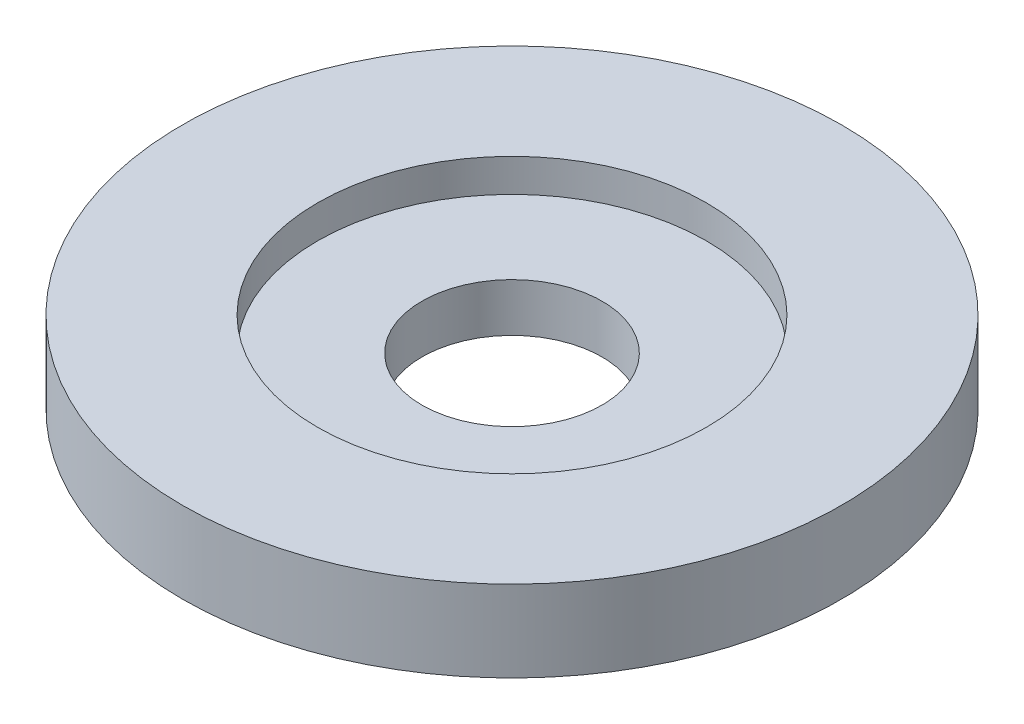
ISO-10303-21;
HEADER;
FILE_DESCRIPTION(('STEP AP214'),'2;1');
FILE_NAME('part.step','',(''),(''),'','','');
FILE_SCHEMA(('AUTOMOTIVE_DESIGN { 1 0 10303 214 1 1 1 1 }'));
ENDSEC;
DATA;
#1=APPLICATION_CONTEXT('core data for automotive mechanical design processes');
#2=APPLICATION_PROTOCOL_DEFINITION('international standard','automotive_design',2000,#1);
#3=PRODUCT_CONTEXT('',#1,'mechanical');
#4=PRODUCT('Part','Part','',(#3));
#5=PRODUCT_RELATED_PRODUCT_CATEGORY('part','',(#4));
#6=PRODUCT_DEFINITION_FORMATION('','',#4);
#7=PRODUCT_DEFINITION_CONTEXT('part definition',#1,'design');
#8=PRODUCT_DEFINITION('design','',#6,#7);
#9=PRODUCT_DEFINITION_SHAPE('','',#8);
#10=(LENGTH_UNIT() NAMED_UNIT(*) SI_UNIT(.MILLI.,.METRE.));
#11=(NAMED_UNIT(*) PLANE_ANGLE_UNIT() SI_UNIT($,.RADIAN.));
#12=(NAMED_UNIT(*) SI_UNIT($,.STERADIAN.) SOLID_ANGLE_UNIT());
#13=UNCERTAINTY_MEASURE_WITH_UNIT(LENGTH_MEASURE(1.E-05),#10,'distance_accuracy_value','');
#14=(GEOMETRIC_REPRESENTATION_CONTEXT(3) GLOBAL_UNCERTAINTY_ASSIGNED_CONTEXT((#13)) GLOBAL_UNIT_ASSIGNED_CONTEXT((#10,
#11,#12)) REPRESENTATION_CONTEXT('',''));
#15=CARTESIAN_POINT('',(0.,0.,0.));
#16=DIRECTION('',(0.,0.,1.));
#17=DIRECTION('',(1.,0.,0.));
#18=AXIS2_PLACEMENT_3D('',#15,#16,#17);
#19=CARTESIAN_POINT('',(0.,-4.699,0.));
#20=DIRECTION('',(0.,1.,0.));
#21=DIRECTION('',(0.,0.,1.));
#22=AXIS2_PLACEMENT_3D('',#19,#20,#21);
#23=CYLINDRICAL_SURFACE('',#22,19.05);
#24=CARTESIAN_POINT('',(0.,-4.699,0.));
#25=DIRECTION('',(0.,1.,0.));
#26=DIRECTION('',(0.,0.,1.));
#27=AXIS2_PLACEMENT_3D('',#24,#25,#26);
#28=CIRCLE('',#27,19.05);
#29=CARTESIAN_POINT('',(0.,-4.699,19.05));
#30=VERTEX_POINT('',#29);
#31=EDGE_CURVE('E10',#30,#30,#28,.T.);
#32=ORIENTED_EDGE('',*,*,#31,.T.);
#33=EDGE_LOOP('',(#32));
#34=FACE_BOUND('',#33,.T.);
#35=CARTESIAN_POINT('',(0.,0.,0.));
#36=DIRECTION('',(0.,1.,0.));
#37=DIRECTION('',(0.,0.,1.));
#38=AXIS2_PLACEMENT_3D('',#35,#36,#37);
#39=CIRCLE('',#38,19.05);
#40=CARTESIAN_POINT('',(0.,0.,19.05));
#41=VERTEX_POINT('',#40);
#42=EDGE_CURVE('E50',#41,#41,#39,.T.);
#43=ORIENTED_EDGE('',*,*,#42,.F.);
#44=EDGE_LOOP('',(#43));
#45=FACE_BOUND('',#44,.T.);
#46=ADVANCED_FACE('F43',(#34,#45),#23,.T.);
#47=CARTESIAN_POINT('',(0.,-4.699,0.));
#48=DIRECTION('',(0.,1.,0.));
#49=DIRECTION('',(0.,0.,1.));
#50=AXIS2_PLACEMENT_3D('',#47,#48,#49);
#51=PLANE('',#50);
#52=CARTESIAN_POINT('',(0.,-4.699,0.));
#53=DIRECTION('',(0.,1.,0.));
#54=DIRECTION('',(0.,0.,1.));
#55=AXIS2_PLACEMENT_3D('',#52,#53,#54);
#56=CIRCLE('',#55,5.207);
#57=CARTESIAN_POINT('',(0.,-4.699,5.207));
#58=VERTEX_POINT('',#57);
#59=EDGE_CURVE('E46',#58,#58,#56,.T.);
#60=ORIENTED_EDGE('',*,*,#59,.T.);
#61=EDGE_LOOP('',(#60));
#62=FACE_BOUND('',#61,.T.);
#63=ORIENTED_EDGE('',*,*,#31,.F.);
#64=EDGE_LOOP('',(#63));
#65=FACE_BOUND('',#64,.T.);
#66=ADVANCED_FACE('F69',(#62,#65),#51,.F.);
#67=CARTESIAN_POINT('',(0.,0.,0.));
#68=DIRECTION('',(0.,1.,0.));
#69=DIRECTION('',(0.,0.,1.));
#70=AXIS2_PLACEMENT_3D('',#67,#68,#69);
#71=PLANE('',#70);
#72=CARTESIAN_POINT('',(0.,0.,0.));
#73=DIRECTION('',(0.,1.,0.));
#74=DIRECTION('',(0.,0.,1.));
#75=AXIS2_PLACEMENT_3D('',#72,#73,#74);
#76=CIRCLE('',#75,11.2395);
#77=CARTESIAN_POINT('',(0.,0.,11.2395));
#78=VERTEX_POINT('',#77);
#79=EDGE_CURVE('E57',#78,#78,#76,.T.);
#80=ORIENTED_EDGE('',*,*,#79,.F.);
#81=EDGE_LOOP('',(#80));
#82=FACE_BOUND('',#81,.T.);
#83=ORIENTED_EDGE('',*,*,#42,.T.);
#84=EDGE_LOOP('',(#83));
#85=FACE_BOUND('',#84,.T.);
#86=ADVANCED_FACE('F87',(#82,#85),#71,.T.);
#87=CARTESIAN_POINT('',(0.,-1.905,0.));
#88=DIRECTION('',(0.,1.,0.));
#89=DIRECTION('',(0.,0.,1.));
#90=AXIS2_PLACEMENT_3D('',#87,#88,#89);
#91=CYLINDRICAL_SURFACE('',#90,11.2395);
#92=CARTESIAN_POINT('',(0.,-1.905,0.));
#93=DIRECTION('',(0.,1.,0.));
#94=DIRECTION('',(0.,0.,1.));
#95=AXIS2_PLACEMENT_3D('',#92,#93,#94);
#96=CIRCLE('',#95,11.2395);
#97=CARTESIAN_POINT('',(0.,-1.905,11.2395));
#98=VERTEX_POINT('',#97);
#99=EDGE_CURVE('E55',#98,#98,#96,.T.);
#100=ORIENTED_EDGE('',*,*,#99,.F.);
#101=EDGE_LOOP('',(#100));
#102=FACE_BOUND('',#101,.T.);
#103=ORIENTED_EDGE('',*,*,#79,.T.);
#104=EDGE_LOOP('',(#103));
#105=FACE_BOUND('',#104,.T.);
#106=ADVANCED_FACE('F79',(#102,#105),#91,.F.);
#107=CARTESIAN_POINT('',(0.,-1.905,0.));
#108=DIRECTION('',(0.,1.,0.));
#109=DIRECTION('',(0.,0.,1.));
#110=AXIS2_PLACEMENT_3D('',#107,#108,#109);
#111=PLANE('',#110);
#112=CARTESIAN_POINT('',(0.,-1.905,0.));
#113=DIRECTION('',(0.,1.,0.));
#114=DIRECTION('',(0.,0.,1.));
#115=AXIS2_PLACEMENT_3D('',#112,#113,#114);
#116=CIRCLE('',#115,5.207);
#117=CARTESIAN_POINT('',(0.,-1.905,5.207));
#118=VERTEX_POINT('',#117);
#119=EDGE_CURVE('E62',#118,#118,#116,.T.);
#120=ORIENTED_EDGE('',*,*,#119,.F.);
#121=EDGE_LOOP('',(#120));
#122=FACE_BOUND('',#121,.T.);
#123=ORIENTED_EDGE('',*,*,#99,.T.);
#124=EDGE_LOOP('',(#123));
#125=FACE_BOUND('',#124,.T.);
#126=ADVANCED_FACE('F74',(#122,#125),#111,.T.);
#127=CARTESIAN_POINT('',(0.,-5.08,0.));
#128=DIRECTION('',(0.,1.,0.));
#129=DIRECTION('',(0.,0.,1.));
#130=AXIS2_PLACEMENT_3D('',#127,#128,#129);
#131=CYLINDRICAL_SURFACE('',#130,5.207);
#132=ORIENTED_EDGE('',*,*,#119,.T.);
#133=EDGE_LOOP('',(#132));
#134=FACE_BOUND('',#133,.T.);
#135=ORIENTED_EDGE('',*,*,#59,.F.);
#136=EDGE_LOOP('',(#135));
#137=FACE_BOUND('',#136,.T.);
#138=ADVANCED_FACE('F72',(#134,#137),#131,.F.);
#139=CLOSED_SHELL('',(#46,#66,#86,#106,#126,#138));
#140=MANIFOLD_SOLID_BREP('B2',#139);
#141=ADVANCED_BREP_SHAPE_REPRESENTATION('',(#18,#140),#14);
#142=SHAPE_DEFINITION_REPRESENTATION(#9,#141);
ENDSEC;
END-ISO-10303-21;
